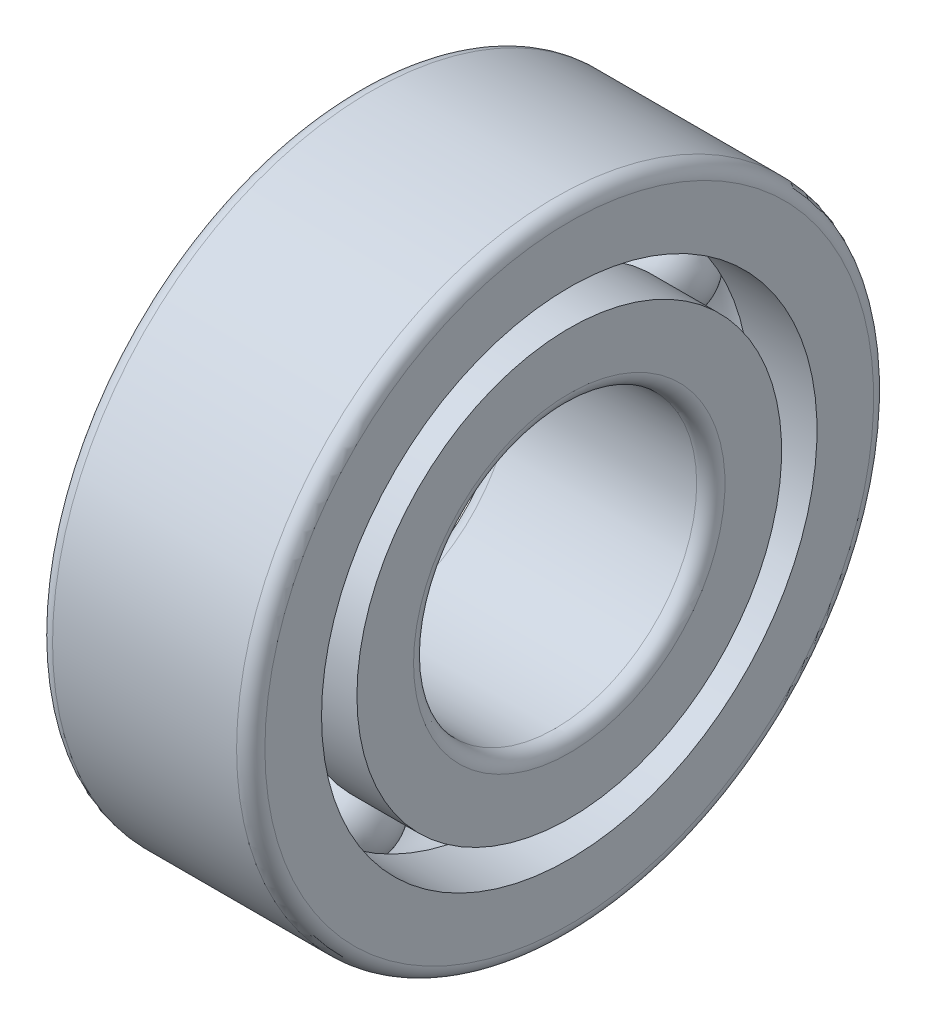
ISO-10303-21;
HEADER;
FILE_DESCRIPTION(('STEP AP214'),'2;1');
FILE_NAME('part.step','',(''),(''),'','','');
FILE_SCHEMA(('AUTOMOTIVE_DESIGN { 1 0 10303 214 1 1 1 1 }'));
ENDSEC;
DATA;
#1=APPLICATION_CONTEXT('core data for automotive mechanical design processes');
#2=APPLICATION_PROTOCOL_DEFINITION('international standard','automotive_design',2000,#1);
#3=PRODUCT_CONTEXT('',#1,'mechanical');
#4=PRODUCT('Part','Part','',(#3));
#5=PRODUCT_RELATED_PRODUCT_CATEGORY('part','',(#4));
#6=PRODUCT_DEFINITION_FORMATION('','',#4);
#7=PRODUCT_DEFINITION_CONTEXT('part definition',#1,'design');
#8=PRODUCT_DEFINITION('design','',#6,#7);
#9=PRODUCT_DEFINITION_SHAPE('','',#8);
#10=(LENGTH_UNIT() NAMED_UNIT(*) SI_UNIT(.MILLI.,.METRE.));
#11=(NAMED_UNIT(*) PLANE_ANGLE_UNIT() SI_UNIT($,.RADIAN.));
#12=(NAMED_UNIT(*) SI_UNIT($,.STERADIAN.) SOLID_ANGLE_UNIT());
#13=UNCERTAINTY_MEASURE_WITH_UNIT(LENGTH_MEASURE(1.E-05),#10,'distance_accuracy_value','');
#14=(GEOMETRIC_REPRESENTATION_CONTEXT(3) GLOBAL_UNCERTAINTY_ASSIGNED_CONTEXT((#13)) GLOBAL_UNIT_ASSIGNED_CONTEXT((#10,
#11,#12)) REPRESENTATION_CONTEXT('',''));
#15=CARTESIAN_POINT('',(0.,0.,0.));
#16=DIRECTION('',(0.,0.,1.));
#17=DIRECTION('',(1.,0.,0.));
#18=AXIS2_PLACEMENT_3D('',#15,#16,#17);
#19=CARTESIAN_POINT('',(7.5,14.3750000000002,-14.0729128114972));
#20=DIRECTION('',(1.,0.,0.));
#21=DIRECTION('',(0.,0.499999999999989,0.866025403784445));
#22=AXIS2_PLACEMENT_3D('',#19,#20,#21);
#23=SPHERICAL_SURFACE('',#22,3.);
#24=CARTESIAN_POINT('',(10.5,14.3750000000002,-14.0729128114972));
#25=VERTEX_POINT('',#24);
#26=VERTEX_LOOP('',#25);
#27=FACE_BOUND('',#26,.T.);
#28=ADVANCED_FACE('F38',(#27),#23,.T.);
#29=CLOSED_SHELL('',(#28));
#30=MANIFOLD_SOLID_BREP('B2',#29);
#31=CARTESIAN_POINT('',(7.5,8.42708718850297,-8.12500000000016));
#32=DIRECTION('',(1.,0.,0.));
#33=DIRECTION('',(0.,0.866025403784433,0.50000000000001));
#34=AXIS2_PLACEMENT_3D('',#31,#32,#33);
#35=SPHERICAL_SURFACE('',#34,3.);
#36=CARTESIAN_POINT('',(10.5,8.42708718850297,-8.12500000000016));
#37=VERTEX_POINT('',#36);
#38=VERTEX_LOOP('',#37);
#39=FACE_BOUND('',#38,.T.);
#40=ADVANCED_FACE('F57',(#39),#35,.T.);
#41=CLOSED_SHELL('',(#40));
#42=MANIFOLD_SOLID_BREP('B6',#41);
#43=CARTESIAN_POINT('',(7.5,6.25,-1.73472347597681E-13));
#44=DIRECTION('',(1.,0.,0.));
#45=DIRECTION('',(0.,1.,0.));
#46=AXIS2_PLACEMENT_3D('',#43,#44,#45);
#47=SPHERICAL_SURFACE('',#46,3.);
#48=CARTESIAN_POINT('',(10.5,6.25,-1.73472347597681E-13));
#49=VERTEX_POINT('',#48);
#50=VERTEX_LOOP('',#49);
#51=FACE_BOUND('',#50,.T.);
#52=ADVANCED_FACE('F76',(#51),#47,.T.);
#53=CLOSED_SHELL('',(#52));
#54=MANIFOLD_SOLID_BREP('B34',#53);
#55=CARTESIAN_POINT('',(7.5,8.4270871885028,8.12499999999987));
#56=DIRECTION('',(1.,0.,0.));
#57=DIRECTION('',(0.,0.866025403784443,-0.499999999999992));
#58=AXIS2_PLACEMENT_3D('',#55,#56,#57);
#59=SPHERICAL_SURFACE('',#58,3.);
#60=CARTESIAN_POINT('',(10.5,8.4270871885028,8.12499999999987));
#61=VERTEX_POINT('',#60);
#62=VERTEX_LOOP('',#61);
#63=FACE_BOUND('',#62,.T.);
#64=ADVANCED_FACE('F95',(#63),#59,.T.);
#65=CLOSED_SHELL('',(#64));
#66=MANIFOLD_SOLID_BREP('B53',#65);
#67=CARTESIAN_POINT('',(7.5,14.3749999999999,14.0729128114971));
#68=DIRECTION('',(1.,0.,0.));
#69=DIRECTION('',(0.,0.500000000000007,-0.866025403784435));
#70=AXIS2_PLACEMENT_3D('',#67,#68,#69);
#71=SPHERICAL_SURFACE('',#70,3.);
#72=CARTESIAN_POINT('',(10.5,14.3749999999999,14.0729128114971));
#73=VERTEX_POINT('',#72);
#74=VERTEX_LOOP('',#73);
#75=FACE_BOUND('',#74,.T.);
#76=ADVANCED_FACE('F114',(#75),#71,.T.);
#77=CLOSED_SHELL('',(#76));
#78=MANIFOLD_SOLID_BREP('B72',#77);
#79=CARTESIAN_POINT('',(7.5,22.5,16.25));
#80=DIRECTION('',(1.,0.,0.));
#81=DIRECTION('',(0.,0.,-1.));
#82=AXIS2_PLACEMENT_3D('',#79,#80,#81);
#83=SPHERICAL_SURFACE('',#82,3.);
#84=CARTESIAN_POINT('',(10.5,22.5,16.25));
#85=VERTEX_POINT('',#84);
#86=VERTEX_LOOP('',#85);
#87=FACE_BOUND('',#86,.T.);
#88=ADVANCED_FACE('F133',(#87),#83,.T.);
#89=CLOSED_SHELL('',(#88));
#90=MANIFOLD_SOLID_BREP('B91',#89);
#91=CARTESIAN_POINT('',(7.5,30.6249999999999,14.0729128114972));
#92=DIRECTION('',(1.,0.,0.));
#93=DIRECTION('',(0.,-0.499999999999995,-0.866025403784442));
#94=AXIS2_PLACEMENT_3D('',#91,#92,#93);
#95=SPHERICAL_SURFACE('',#94,3.);
#96=CARTESIAN_POINT('',(10.5,30.6249999999999,14.0729128114972));
#97=VERTEX_POINT('',#96);
#98=VERTEX_LOOP('',#97);
#99=FACE_BOUND('',#98,.T.);
#100=ADVANCED_FACE('F152',(#99),#95,.T.);
#101=CLOSED_SHELL('',(#100));
#102=MANIFOLD_SOLID_BREP('B110',#101);
#103=CARTESIAN_POINT('',(7.5,36.5729128114971,8.12500000000006));
#104=DIRECTION('',(1.,0.,0.));
#105=DIRECTION('',(0.,-0.866025403784436,-0.500000000000004));
#106=AXIS2_PLACEMENT_3D('',#103,#104,#105);
#107=SPHERICAL_SURFACE('',#106,3.);
#108=CARTESIAN_POINT('',(10.5,36.5729128114971,8.12500000000006));
#109=VERTEX_POINT('',#108);
#110=VERTEX_LOOP('',#109);
#111=FACE_BOUND('',#110,.T.);
#112=ADVANCED_FACE('F171',(#111),#107,.T.);
#113=CLOSED_SHELL('',(#112));
#114=MANIFOLD_SOLID_BREP('B129',#113);
#115=CARTESIAN_POINT('',(7.5,38.75,0.));
#116=DIRECTION('',(1.,0.,0.));
#117=DIRECTION('',(0.,-1.,0.));
#118=AXIS2_PLACEMENT_3D('',#115,#116,#117);
#119=SPHERICAL_SURFACE('',#118,3.);
#120=CARTESIAN_POINT('',(10.5,38.75,0.));
#121=VERTEX_POINT('',#120);
#122=VERTEX_LOOP('',#121);
#123=FACE_BOUND('',#122,.T.);
#124=ADVANCED_FACE('F190',(#123),#119,.T.);
#125=CLOSED_SHELL('',(#124));
#126=MANIFOLD_SOLID_BREP('B148',#125);
#127=CARTESIAN_POINT('',(7.5,36.5729128114971,-8.12499999999997));
#128=DIRECTION('',(1.,0.,0.));
#129=DIRECTION('',(0.,-0.86602540378444,0.499999999999998));
#130=AXIS2_PLACEMENT_3D('',#127,#128,#129);
#131=SPHERICAL_SURFACE('',#130,3.);
#132=CARTESIAN_POINT('',(10.5,36.5729128114971,-8.12499999999997));
#133=VERTEX_POINT('',#132);
#134=VERTEX_LOOP('',#133);
#135=FACE_BOUND('',#134,.T.);
#136=ADVANCED_FACE('F209',(#135),#131,.T.);
#137=CLOSED_SHELL('',(#136));
#138=MANIFOLD_SOLID_BREP('B167',#137);
#139=CARTESIAN_POINT('',(7.5,30.625,-14.0729128114971));
#140=DIRECTION('',(1.,0.,0.));
#141=DIRECTION('',(0.,-0.500000000000001,0.866025403784438));
#142=AXIS2_PLACEMENT_3D('',#139,#140,#141);
#143=SPHERICAL_SURFACE('',#142,3.);
#144=CARTESIAN_POINT('',(10.5,30.625,-14.0729128114971));
#145=VERTEX_POINT('',#144);
#146=VERTEX_LOOP('',#145);
#147=FACE_BOUND('',#146,.T.);
#148=ADVANCED_FACE('F228',(#147),#143,.T.);
#149=CLOSED_SHELL('',(#148));
#150=MANIFOLD_SOLID_BREP('B186',#149);
#151=CARTESIAN_POINT('',(7.5,22.5,-16.25));
#152=DIRECTION('',(1.,0.,0.));
#153=DIRECTION('',(0.,0.,1.));
#154=AXIS2_PLACEMENT_3D('',#151,#152,#153);
#155=SPHERICAL_SURFACE('',#154,3.);
#156=CARTESIAN_POINT('',(10.5,22.5,-16.25));
#157=VERTEX_POINT('',#156);
#158=VERTEX_LOOP('',#157);
#159=FACE_BOUND('',#158,.T.);
#160=ADVANCED_FACE('F249',(#159),#155,.T.);
#161=CLOSED_SHELL('',(#160));
#162=MANIFOLD_SOLID_BREP('B205',#161);
#163=CARTESIAN_POINT('',(7.5,22.5,0.));
#164=DIRECTION('',(-1.,0.,0.));
#165=DIRECTION('',(0.,0.,1.));
#166=AXIS2_PLACEMENT_3D('',#163,#164,#165);
#167=TOROIDAL_SURFACE('',#166,16.25,3.);
#168=CARTESIAN_POINT('',(10.2271780286589,22.5,0.));
#169=DIRECTION('',(-1.,0.,0.));
#170=DIRECTION('',(0.,0.,1.));
#171=AXIS2_PLACEMENT_3D('',#168,#169,#170);
#172=CIRCLE('',#171,17.5);
#173=CARTESIAN_POINT('',(10.2271780286589,22.5,17.5));
#174=VERTEX_POINT('',#173);
#175=EDGE_CURVE('E298',#174,#174,#172,.T.);
#176=ORIENTED_EDGE('',*,*,#175,.F.);
#177=EDGE_LOOP('',(#176));
#178=FACE_BOUND('',#177,.T.);
#179=CARTESIAN_POINT('',(4.77282197134107,22.5,0.));
#180=DIRECTION('',(-1.,0.,0.));
#181=DIRECTION('',(0.,0.,1.));
#182=AXIS2_PLACEMENT_3D('',#179,#180,#181);
#183=CIRCLE('',#182,17.5);
#184=CARTESIAN_POINT('',(4.77282197134107,22.5,17.5));
#185=VERTEX_POINT('',#184);
#186=EDGE_CURVE('E289',#185,#185,#183,.T.);
#187=ORIENTED_EDGE('',*,*,#186,.T.);
#188=EDGE_LOOP('',(#187));
#189=FACE_BOUND('',#188,.T.);
#190=ADVANCED_FACE('F269',(#178,#189),#167,.F.);
#191=CARTESIAN_POINT('',(0.,22.5,0.));
#192=DIRECTION('',(-1.,0.,0.));
#193=DIRECTION('',(0.,0.,1.));
#194=AXIS2_PLACEMENT_3D('',#191,#192,#193);
#195=CYLINDRICAL_SURFACE('',#194,17.5);
#196=ORIENTED_EDGE('',*,*,#186,.F.);
#197=EDGE_LOOP('',(#196));
#198=FACE_BOUND('',#197,.T.);
#199=CARTESIAN_POINT('',(0.,22.5,0.));
#200=DIRECTION('',(-1.,0.,0.));
#201=DIRECTION('',(0.,0.,1.));
#202=AXIS2_PLACEMENT_3D('',#199,#200,#201);
#203=CIRCLE('',#202,17.5);
#204=CARTESIAN_POINT('',(0.,22.5,17.5));
#205=VERTEX_POINT('',#204);
#206=EDGE_CURVE('E292',#205,#205,#203,.T.);
#207=ORIENTED_EDGE('',*,*,#206,.T.);
#208=EDGE_LOOP('',(#207));
#209=FACE_BOUND('',#208,.T.);
#210=ADVANCED_FACE('F306',(#198,#209),#195,.F.);
#211=CARTESIAN_POINT('',(0.,0.,0.));
#212=DIRECTION('',(-1.,0.,0.));
#213=DIRECTION('',(0.,0.,1.));
#214=AXIS2_PLACEMENT_3D('',#211,#212,#213);
#215=PLANE('',#214);
#216=CARTESIAN_POINT('',(0.,22.5,0.));
#217=DIRECTION('',(-1.,0.,0.));
#218=DIRECTION('',(0.,0.,1.));
#219=AXIS2_PLACEMENT_3D('',#216,#217,#218);
#220=CIRCLE('',#219,21.5);
#221=CARTESIAN_POINT('',(0.,22.5,21.5));
#222=VERTEX_POINT('',#221);
#223=EDGE_CURVE('E284',#222,#222,#220,.T.);
#224=ORIENTED_EDGE('',*,*,#223,.T.);
#225=EDGE_LOOP('',(#224));
#226=FACE_BOUND('',#225,.T.);
#227=ORIENTED_EDGE('',*,*,#206,.F.);
#228=EDGE_LOOP('',(#227));
#229=FACE_BOUND('',#228,.T.);
#230=ADVANCED_FACE('F312',(#226,#229),#215,.T.);
#231=CARTESIAN_POINT('',(0.,22.5,0.));
#232=DIRECTION('',(-1.,0.,0.));
#233=DIRECTION('',(0.,0.,1.));
#234=AXIS2_PLACEMENT_3D('',#231,#232,#233);
#235=CYLINDRICAL_SURFACE('',#234,22.5);
#236=CARTESIAN_POINT('',(1.,22.5,0.));
#237=DIRECTION('',(-1.,0.,0.));
#238=DIRECTION('',(0.,0.,1.));
#239=AXIS2_PLACEMENT_3D('',#236,#237,#238);
#240=CIRCLE('',#239,22.5);
#241=CARTESIAN_POINT('',(1.,22.5,22.5));
#242=VERTEX_POINT('',#241);
#243=EDGE_CURVE('E276',#242,#242,#240,.F.);
#244=ORIENTED_EDGE('',*,*,#243,.T.);
#245=EDGE_LOOP('',(#244));
#246=FACE_BOUND('',#245,.T.);
#247=CARTESIAN_POINT('',(14.,22.5,0.));
#248=DIRECTION('',(-1.,0.,0.));
#249=DIRECTION('',(0.,0.,1.));
#250=AXIS2_PLACEMENT_3D('',#247,#248,#249);
#251=CIRCLE('',#250,22.5);
#252=CARTESIAN_POINT('',(14.,22.5,22.5));
#253=VERTEX_POINT('',#252);
#254=EDGE_CURVE('E280',#253,#253,#251,.T.);
#255=ORIENTED_EDGE('',*,*,#254,.T.);
#256=EDGE_LOOP('',(#255));
#257=FACE_BOUND('',#256,.T.);
#258=ADVANCED_FACE('F317',(#246,#257),#235,.T.);
#259=CARTESIAN_POINT('',(15.,0.,0.));
#260=DIRECTION('',(-1.,0.,0.));
#261=DIRECTION('',(0.,0.,1.));
#262=AXIS2_PLACEMENT_3D('',#259,#260,#261);
#263=PLANE('',#262);
#264=CARTESIAN_POINT('',(15.,22.5,0.));
#265=DIRECTION('',(-1.,0.,0.));
#266=DIRECTION('',(0.,0.,1.));
#267=AXIS2_PLACEMENT_3D('',#264,#265,#266);
#268=CIRCLE('',#267,21.5);
#269=CARTESIAN_POINT('',(15.,22.5,21.5));
#270=VERTEX_POINT('',#269);
#271=EDGE_CURVE('E248',#270,#270,#268,.F.);
#272=ORIENTED_EDGE('',*,*,#271,.T.);
#273=EDGE_LOOP('',(#272));
#274=FACE_BOUND('',#273,.T.);
#275=CARTESIAN_POINT('',(15.,22.5,0.));
#276=DIRECTION('',(-1.,0.,0.));
#277=DIRECTION('',(0.,0.,1.));
#278=AXIS2_PLACEMENT_3D('',#275,#276,#277);
#279=CIRCLE('',#278,17.5);
#280=CARTESIAN_POINT('',(15.,22.5,17.5));
#281=VERTEX_POINT('',#280);
#282=EDGE_CURVE('E295',#281,#281,#279,.T.);
#283=ORIENTED_EDGE('',*,*,#282,.T.);
#284=EDGE_LOOP('',(#283));
#285=FACE_BOUND('',#284,.T.);
#286=ADVANCED_FACE('F323',(#274,#285),#263,.F.);
#287=CARTESIAN_POINT('',(0.,22.5,0.));
#288=DIRECTION('',(-1.,0.,0.));
#289=DIRECTION('',(0.,0.,1.));
#290=AXIS2_PLACEMENT_3D('',#287,#288,#289);
#291=CYLINDRICAL_SURFACE('',#290,17.5);
#292=ORIENTED_EDGE('',*,*,#282,.F.);
#293=EDGE_LOOP('',(#292));
#294=FACE_BOUND('',#293,.T.);
#295=ORIENTED_EDGE('',*,*,#175,.T.);
#296=EDGE_LOOP('',(#295));
#297=FACE_BOUND('',#296,.T.);
#298=ADVANCED_FACE('F302',(#294,#297),#291,.F.);
#299=CARTESIAN_POINT('',(1.,22.5,0.));
#300=DIRECTION('',(-1.,0.,0.));
#301=DIRECTION('',(0.,0.,1.));
#302=AXIS2_PLACEMENT_3D('',#299,#300,#301);
#303=TOROIDAL_SURFACE('',#302,21.5,1.);
#304=ORIENTED_EDGE('',*,*,#243,.F.);
#305=EDGE_LOOP('',(#304));
#306=FACE_BOUND('',#305,.T.);
#307=ORIENTED_EDGE('',*,*,#223,.F.);
#308=EDGE_LOOP('',(#307));
#309=FACE_BOUND('',#308,.T.);
#310=ADVANCED_FACE('F326',(#306,#309),#303,.T.);
#311=CARTESIAN_POINT('',(14.,22.5,0.));
#312=DIRECTION('',(-1.,0.,0.));
#313=DIRECTION('',(0.,0.,1.));
#314=AXIS2_PLACEMENT_3D('',#311,#312,#313);
#315=TOROIDAL_SURFACE('',#314,21.5,1.);
#316=ORIENTED_EDGE('',*,*,#271,.F.);
#317=EDGE_LOOP('',(#316));
#318=FACE_BOUND('',#317,.T.);
#319=ORIENTED_EDGE('',*,*,#254,.F.);
#320=EDGE_LOOP('',(#319));
#321=FACE_BOUND('',#320,.T.);
#322=ADVANCED_FACE('F271',(#318,#321),#315,.T.);
#323=CLOSED_SHELL('',(#190,#210,#230,#258,#286,#298,#310,#322));
#324=MANIFOLD_SOLID_BREP('B224',#323);
#325=CARTESIAN_POINT('',(7.5,22.5,0.));
#326=DIRECTION('',(-1.,0.,0.));
#327=DIRECTION('',(0.,0.,1.));
#328=AXIS2_PLACEMENT_3D('',#325,#326,#327);
#329=TOROIDAL_SURFACE('',#328,16.25,3.);
#330=CARTESIAN_POINT('',(4.77282197134107,22.5,0.));
#331=DIRECTION('',(-1.,0.,0.));
#332=DIRECTION('',(0.,0.,1.));
#333=AXIS2_PLACEMENT_3D('',#330,#331,#332);
#334=CIRCLE('',#333,15.);
#335=CARTESIAN_POINT('',(4.77282197134107,22.5,15.));
#336=VERTEX_POINT('',#335);
#337=EDGE_CURVE('E420',#336,#336,#334,.T.);
#338=ORIENTED_EDGE('',*,*,#337,.F.);
#339=EDGE_LOOP('',(#338));
#340=FACE_BOUND('',#339,.T.);
#341=CARTESIAN_POINT('',(10.2271780286589,22.5,0.));
#342=DIRECTION('',(-1.,0.,0.));
#343=DIRECTION('',(0.,0.,1.));
#344=AXIS2_PLACEMENT_3D('',#341,#342,#343);
#345=CIRCLE('',#344,15.);
#346=CARTESIAN_POINT('',(10.2271780286589,22.5,15.));
#347=VERTEX_POINT('',#346);
#348=EDGE_CURVE('E411',#347,#347,#345,.T.);
#349=ORIENTED_EDGE('',*,*,#348,.T.);
#350=EDGE_LOOP('',(#349));
#351=FACE_BOUND('',#350,.T.);
#352=ADVANCED_FACE('F391',(#340,#351),#329,.F.);
#353=CARTESIAN_POINT('',(0.,22.5,0.));
#354=DIRECTION('',(-1.,0.,0.));
#355=DIRECTION('',(0.,0.,1.));
#356=AXIS2_PLACEMENT_3D('',#353,#354,#355);
#357=CYLINDRICAL_SURFACE('',#356,15.);
#358=CARTESIAN_POINT('',(15.,22.5,0.));
#359=DIRECTION('',(-1.,0.,0.));
#360=DIRECTION('',(0.,0.,1.));
#361=AXIS2_PLACEMENT_3D('',#358,#359,#360);
#362=CIRCLE('',#361,15.);
#363=CARTESIAN_POINT('',(15.,22.5,15.));
#364=VERTEX_POINT('',#363);
#365=EDGE_CURVE('E414',#364,#364,#362,.T.);
#366=ORIENTED_EDGE('',*,*,#365,.T.);
#367=EDGE_LOOP('',(#366));
#368=FACE_BOUND('',#367,.T.);
#369=ORIENTED_EDGE('',*,*,#348,.F.);
#370=EDGE_LOOP('',(#369));
#371=FACE_BOUND('',#370,.T.);
#372=ADVANCED_FACE('F429',(#368,#371),#357,.T.);
#373=CARTESIAN_POINT('',(15.,0.,0.));
#374=DIRECTION('',(-1.,0.,0.));
#375=DIRECTION('',(0.,0.,1.));
#376=AXIS2_PLACEMENT_3D('',#373,#374,#375);
#377=PLANE('',#376);
#378=CARTESIAN_POINT('',(15.,22.5,0.));
#379=DIRECTION('',(-1.,0.,0.));
#380=DIRECTION('',(0.,0.,1.));
#381=AXIS2_PLACEMENT_3D('',#378,#379,#380);
#382=CIRCLE('',#381,11.);
#383=CARTESIAN_POINT('',(15.,22.5,11.));
#384=VERTEX_POINT('',#383);
#385=EDGE_CURVE('E406',#384,#384,#382,.T.);
#386=ORIENTED_EDGE('',*,*,#385,.T.);
#387=EDGE_LOOP('',(#386));
#388=FACE_BOUND('',#387,.T.);
#389=ORIENTED_EDGE('',*,*,#365,.F.);
#390=EDGE_LOOP('',(#389));
#391=FACE_BOUND('',#390,.T.);
#392=ADVANCED_FACE('F434',(#388,#391),#377,.F.);
#393=CARTESIAN_POINT('',(0.,22.5,0.));
#394=DIRECTION('',(-1.,0.,0.));
#395=DIRECTION('',(0.,0.,1.));
#396=AXIS2_PLACEMENT_3D('',#393,#394,#395);
#397=CYLINDRICAL_SURFACE('',#396,10.);
#398=CARTESIAN_POINT('',(14.,22.5,0.));
#399=DIRECTION('',(-1.,0.,0.));
#400=DIRECTION('',(0.,0.,1.));
#401=AXIS2_PLACEMENT_3D('',#398,#399,#400);
#402=CIRCLE('',#401,10.);
#403=CARTESIAN_POINT('',(14.,22.5,10.));
#404=VERTEX_POINT('',#403);
#405=EDGE_CURVE('E398',#404,#404,#402,.F.);
#406=ORIENTED_EDGE('',*,*,#405,.T.);
#407=EDGE_LOOP('',(#406));
#408=FACE_BOUND('',#407,.T.);
#409=CARTESIAN_POINT('',(1.,22.5,0.));
#410=DIRECTION('',(-1.,0.,0.));
#411=DIRECTION('',(0.,0.,1.));
#412=AXIS2_PLACEMENT_3D('',#409,#410,#411);
#413=CIRCLE('',#412,10.);
#414=CARTESIAN_POINT('',(1.,22.5,10.));
#415=VERTEX_POINT('',#414);
#416=EDGE_CURVE('E402',#415,#415,#413,.T.);
#417=ORIENTED_EDGE('',*,*,#416,.T.);
#418=EDGE_LOOP('',(#417));
#419=FACE_BOUND('',#418,.T.);
#420=ADVANCED_FACE('F440',(#408,#419),#397,.F.);
#421=CARTESIAN_POINT('',(0.,0.,0.));
#422=DIRECTION('',(-1.,0.,0.));
#423=DIRECTION('',(0.,0.,1.));
#424=AXIS2_PLACEMENT_3D('',#421,#422,#423);
#425=PLANE('',#424);
#426=CARTESIAN_POINT('',(0.,22.5,0.));
#427=DIRECTION('',(-1.,0.,0.));
#428=DIRECTION('',(0.,0.,1.));
#429=AXIS2_PLACEMENT_3D('',#426,#427,#428);
#430=CIRCLE('',#429,11.);
#431=CARTESIAN_POINT('',(0.,22.5,11.));
#432=VERTEX_POINT('',#431);
#433=EDGE_CURVE('E268',#432,#432,#430,.F.);
#434=ORIENTED_EDGE('',*,*,#433,.T.);
#435=EDGE_LOOP('',(#434));
#436=FACE_BOUND('',#435,.T.);
#437=CARTESIAN_POINT('',(0.,22.5,0.));
#438=DIRECTION('',(-1.,0.,0.));
#439=DIRECTION('',(0.,0.,1.));
#440=AXIS2_PLACEMENT_3D('',#437,#438,#439);
#441=CIRCLE('',#440,15.);
#442=CARTESIAN_POINT('',(0.,22.5,15.));
#443=VERTEX_POINT('',#442);
#444=EDGE_CURVE('E417',#443,#443,#441,.T.);
#445=ORIENTED_EDGE('',*,*,#444,.T.);
#446=EDGE_LOOP('',(#445));
#447=FACE_BOUND('',#446,.T.);
#448=ADVANCED_FACE('F452',(#436,#447),#425,.T.);
#449=CARTESIAN_POINT('',(0.,22.5,0.));
#450=DIRECTION('',(-1.,0.,0.));
#451=DIRECTION('',(0.,0.,1.));
#452=AXIS2_PLACEMENT_3D('',#449,#450,#451);
#453=CYLINDRICAL_SURFACE('',#452,15.);
#454=ORIENTED_EDGE('',*,*,#337,.T.);
#455=EDGE_LOOP('',(#454));
#456=FACE_BOUND('',#455,.T.);
#457=ORIENTED_EDGE('',*,*,#444,.F.);
#458=EDGE_LOOP('',(#457));
#459=FACE_BOUND('',#458,.T.);
#460=ADVANCED_FACE('F424',(#456,#459),#453,.T.);
#461=CARTESIAN_POINT('',(14.,22.5,0.));
#462=DIRECTION('',(-1.,0.,0.));
#463=DIRECTION('',(0.,0.,1.));
#464=AXIS2_PLACEMENT_3D('',#461,#462,#463);
#465=TOROIDAL_SURFACE('',#464,11.,1.);
#466=ORIENTED_EDGE('',*,*,#405,.F.);
#467=EDGE_LOOP('',(#466));
#468=FACE_BOUND('',#467,.T.);
#469=ORIENTED_EDGE('',*,*,#385,.F.);
#470=EDGE_LOOP('',(#469));
#471=FACE_BOUND('',#470,.T.);
#472=ADVANCED_FACE('F444',(#468,#471),#465,.T.);
#473=CARTESIAN_POINT('',(1.,22.5,0.));
#474=DIRECTION('',(-1.,0.,0.));
#475=DIRECTION('',(0.,0.,1.));
#476=AXIS2_PLACEMENT_3D('',#473,#474,#475);
#477=TOROIDAL_SURFACE('',#476,11.,1.);
#478=ORIENTED_EDGE('',*,*,#433,.F.);
#479=EDGE_LOOP('',(#478));
#480=FACE_BOUND('',#479,.T.);
#481=ORIENTED_EDGE('',*,*,#416,.F.);
#482=EDGE_LOOP('',(#481));
#483=FACE_BOUND('',#482,.T.);
#484=ADVANCED_FACE('F393',(#480,#483),#477,.T.);
#485=CLOSED_SHELL('',(#352,#372,#392,#420,#448,#460,#472,#484));
#486=MANIFOLD_SOLID_BREP('B243',#485);
#487=ADVANCED_BREP_SHAPE_REPRESENTATION('',(#18,#30,#42,#54,#66,#78,#90,#102,#114,#126,#138,
#150,#162,#324,#486),#14);
#488=SHAPE_DEFINITION_REPRESENTATION(#9,#487);
ENDSEC;
END-ISO-10303-21;
